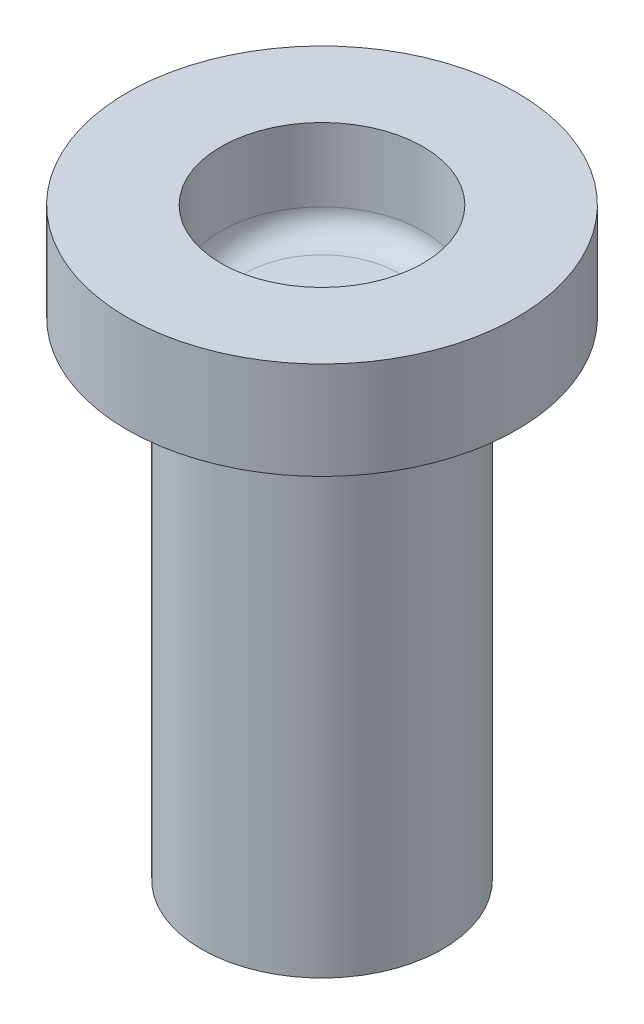
ISO-10303-21;
HEADER;
FILE_DESCRIPTION(('STEP AP214'),'2;1');
FILE_NAME('part.step','',(''),(''),'','','');
FILE_SCHEMA(('AUTOMOTIVE_DESIGN { 1 0 10303 214 1 1 1 1 }'));
ENDSEC;
DATA;
#1=APPLICATION_CONTEXT('core data for automotive mechanical design processes');
#2=APPLICATION_PROTOCOL_DEFINITION('international standard','automotive_design',2000,#1);
#3=PRODUCT_CONTEXT('',#1,'mechanical');
#4=PRODUCT('Part','Part','',(#3));
#5=PRODUCT_RELATED_PRODUCT_CATEGORY('part','',(#4));
#6=PRODUCT_DEFINITION_FORMATION('','',#4);
#7=PRODUCT_DEFINITION_CONTEXT('part definition',#1,'design');
#8=PRODUCT_DEFINITION('design','',#6,#7);
#9=PRODUCT_DEFINITION_SHAPE('','',#8);
#10=(LENGTH_UNIT() NAMED_UNIT(*) SI_UNIT(.MILLI.,.METRE.));
#11=(NAMED_UNIT(*) PLANE_ANGLE_UNIT() SI_UNIT($,.RADIAN.));
#12=(NAMED_UNIT(*) SI_UNIT($,.STERADIAN.) SOLID_ANGLE_UNIT());
#13=UNCERTAINTY_MEASURE_WITH_UNIT(LENGTH_MEASURE(1.E-05),#10,'distance_accuracy_value','');
#14=(GEOMETRIC_REPRESENTATION_CONTEXT(3) GLOBAL_UNCERTAINTY_ASSIGNED_CONTEXT((#13)) GLOBAL_UNIT_ASSIGNED_CONTEXT((#10,
#11,#12)) REPRESENTATION_CONTEXT('',''));
#15=CARTESIAN_POINT('',(0.,0.,0.));
#16=DIRECTION('',(0.,0.,1.));
#17=DIRECTION('',(1.,0.,0.));
#18=AXIS2_PLACEMENT_3D('',#15,#16,#17);
#19=CARTESIAN_POINT('',(0.,0.,0.));
#20=DIRECTION('',(0.,1.,0.));
#21=DIRECTION('',(0.,0.,1.));
#22=AXIS2_PLACEMENT_3D('',#19,#20,#21);
#23=PLANE('',#22);
#24=CARTESIAN_POINT('',(0.,0.,0.));
#25=DIRECTION('',(0.,1.,0.));
#26=DIRECTION('',(0.,0.,1.));
#27=AXIS2_PLACEMENT_3D('',#24,#25,#26);
#28=CIRCLE('',#27,2.475);
#29=CARTESIAN_POINT('',(0.,0.,2.475));
#30=VERTEX_POINT('',#29);
#31=EDGE_CURVE('E67',#30,#30,#28,.T.);
#32=ORIENTED_EDGE('',*,*,#31,.F.);
#33=EDGE_LOOP('',(#32));
#34=FACE_BOUND('',#33,.T.);
#35=CARTESIAN_POINT('',(0.,0.,0.));
#36=DIRECTION('',(0.,1.,0.));
#37=DIRECTION('',(0.,0.,1.));
#38=AXIS2_PLACEMENT_3D('',#35,#36,#37);
#39=CIRCLE('',#38,1.5);
#40=CARTESIAN_POINT('',(0.,0.,1.5));
#41=VERTEX_POINT('',#40);
#42=EDGE_CURVE('E71',#41,#41,#39,.T.);
#43=ORIENTED_EDGE('',*,*,#42,.T.);
#44=EDGE_LOOP('',(#43));
#45=FACE_BOUND('',#44,.T.);
#46=ADVANCED_FACE('F43',(#34,#45),#23,.F.);
#47=CARTESIAN_POINT('',(0.,5.,0.));
#48=DIRECTION('',(0.,-1.,0.));
#49=DIRECTION('',(0.,0.,-1.));
#50=AXIS2_PLACEMENT_3D('',#47,#48,#49);
#51=CYLINDRICAL_SURFACE('',#50,2.475);
#52=CARTESIAN_POINT('',(0.,9.5,0.));
#53=DIRECTION('',(0.,1.,0.));
#54=DIRECTION('',(0.,0.,1.));
#55=AXIS2_PLACEMENT_3D('',#52,#53,#54);
#56=CIRCLE('',#55,2.475);
#57=CARTESIAN_POINT('',(0.,9.5,2.475));
#58=VERTEX_POINT('',#57);
#59=EDGE_CURVE('E10',#58,#58,#56,.F.);
#60=ORIENTED_EDGE('',*,*,#59,.T.);
#61=EDGE_LOOP('',(#60));
#62=FACE_BOUND('',#61,.T.);
#63=ORIENTED_EDGE('',*,*,#31,.T.);
#64=EDGE_LOOP('',(#63));
#65=FACE_BOUND('',#64,.T.);
#66=ADVANCED_FACE('F117',(#62,#65),#51,.T.);
#67=CARTESIAN_POINT('',(0.,5.,0.));
#68=DIRECTION('',(0.,-1.,0.));
#69=DIRECTION('',(0.,0.,-1.));
#70=AXIS2_PLACEMENT_3D('',#67,#68,#69);
#71=CYLINDRICAL_SURFACE('',#70,1.5);
#72=CARTESIAN_POINT('',(0.,5.,0.));
#73=DIRECTION('',(0.,1.,0.));
#74=DIRECTION('',(0.,0.,1.));
#75=AXIS2_PLACEMENT_3D('',#72,#73,#74);
#76=CIRCLE('',#75,1.5);
#77=CARTESIAN_POINT('',(0.,5.,1.5));
#78=VERTEX_POINT('',#77);
#79=EDGE_CURVE('E75',#78,#78,#76,.T.);
#80=ORIENTED_EDGE('',*,*,#79,.T.);
#81=EDGE_LOOP('',(#80));
#82=FACE_BOUND('',#81,.T.);
#83=ORIENTED_EDGE('',*,*,#42,.F.);
#84=EDGE_LOOP('',(#83));
#85=FACE_BOUND('',#84,.T.);
#86=ADVANCED_FACE('F123',(#82,#85),#71,.F.);
#87=CARTESIAN_POINT('',(0.,5.,0.));
#88=DIRECTION('',(0.,1.,0.));
#89=DIRECTION('',(0.,0.,1.));
#90=AXIS2_PLACEMENT_3D('',#87,#88,#89);
#91=PLANE('',#90);
#92=ORIENTED_EDGE('',*,*,#79,.F.);
#93=EDGE_LOOP('',(#92));
#94=FACE_BOUND('',#93,.T.);
#95=ADVANCED_FACE('F99',(#94),#91,.F.);
#96=CARTESIAN_POINT('',(0.,12.,0.));
#97=DIRECTION('',(0.,-1.,0.));
#98=DIRECTION('',(0.,0.,-1.));
#99=AXIS2_PLACEMENT_3D('',#96,#97,#98);
#100=CYLINDRICAL_SURFACE('',#99,4.);
#101=CARTESIAN_POINT('',(0.,12.,0.));
#102=DIRECTION('',(0.,1.,0.));
#103=DIRECTION('',(0.,0.,1.));
#104=AXIS2_PLACEMENT_3D('',#101,#102,#103);
#105=CIRCLE('',#104,4.);
#106=CARTESIAN_POINT('',(0.,12.,4.));
#107=VERTEX_POINT('',#106);
#108=EDGE_CURVE('E84',#107,#107,#105,.T.);
#109=ORIENTED_EDGE('',*,*,#108,.F.);
#110=EDGE_LOOP('',(#109));
#111=FACE_BOUND('',#110,.T.);
#112=CARTESIAN_POINT('',(0.,10.,0.));
#113=DIRECTION('',(0.,1.,0.));
#114=DIRECTION('',(0.,0.,1.));
#115=AXIS2_PLACEMENT_3D('',#112,#113,#114);
#116=CIRCLE('',#115,4.);
#117=CARTESIAN_POINT('',(0.,10.,4.));
#118=VERTEX_POINT('',#117);
#119=EDGE_CURVE('E80',#118,#118,#116,.T.);
#120=ORIENTED_EDGE('',*,*,#119,.T.);
#121=EDGE_LOOP('',(#120));
#122=FACE_BOUND('',#121,.T.);
#123=ADVANCED_FACE('F95',(#111,#122),#100,.T.);
#124=CARTESIAN_POINT('',(0.,12.,0.));
#125=DIRECTION('',(0.,-1.,0.));
#126=DIRECTION('',(0.,0.,-1.));
#127=AXIS2_PLACEMENT_3D('',#124,#125,#126);
#128=CYLINDRICAL_SURFACE('',#127,2.075);
#129=CARTESIAN_POINT('',(0.,10.5,0.));
#130=DIRECTION('',(0.,1.,0.));
#131=DIRECTION('',(0.,0.,1.));
#132=AXIS2_PLACEMENT_3D('',#129,#130,#131);
#133=CIRCLE('',#132,2.075);
#134=CARTESIAN_POINT('',(0.,10.5,2.075));
#135=VERTEX_POINT('',#134);
#136=EDGE_CURVE('E61',#135,#135,#133,.F.);
#137=ORIENTED_EDGE('',*,*,#136,.T.);
#138=EDGE_LOOP('',(#137));
#139=FACE_BOUND('',#138,.T.);
#140=CARTESIAN_POINT('',(0.,12.,0.));
#141=DIRECTION('',(0.,1.,0.));
#142=DIRECTION('',(0.,0.,1.));
#143=AXIS2_PLACEMENT_3D('',#140,#141,#142);
#144=CIRCLE('',#143,2.075);
#145=CARTESIAN_POINT('',(0.,12.,2.075));
#146=VERTEX_POINT('',#145);
#147=EDGE_CURVE('E79',#146,#146,#144,.T.);
#148=ORIENTED_EDGE('',*,*,#147,.T.);
#149=EDGE_LOOP('',(#148));
#150=FACE_BOUND('',#149,.T.);
#151=ADVANCED_FACE('F98',(#139,#150),#128,.F.);
#152=CARTESIAN_POINT('',(0.,12.,0.));
#153=DIRECTION('',(0.,1.,0.));
#154=DIRECTION('',(0.,0.,1.));
#155=AXIS2_PLACEMENT_3D('',#152,#153,#154);
#156=PLANE('',#155);
#157=ORIENTED_EDGE('',*,*,#108,.T.);
#158=EDGE_LOOP('',(#157));
#159=FACE_BOUND('',#158,.T.);
#160=ORIENTED_EDGE('',*,*,#147,.F.);
#161=EDGE_LOOP('',(#160));
#162=FACE_BOUND('',#161,.T.);
#163=ADVANCED_FACE('F92',(#159,#162),#156,.T.);
#164=CARTESIAN_POINT('',(0.,10.,0.));
#165=DIRECTION('',(0.,1.,0.));
#166=DIRECTION('',(0.,0.,1.));
#167=AXIS2_PLACEMENT_3D('',#164,#165,#166);
#168=PLANE('',#167);
#169=CARTESIAN_POINT('',(0.,10.,0.));
#170=DIRECTION('',(0.,1.,0.));
#171=DIRECTION('',(0.,0.,1.));
#172=AXIS2_PLACEMENT_3D('',#169,#170,#171);
#173=CIRCLE('',#172,2.975);
#174=CARTESIAN_POINT('',(0.,10.,2.975));
#175=VERTEX_POINT('',#174);
#176=EDGE_CURVE('E51',#175,#175,#173,.T.);
#177=ORIENTED_EDGE('',*,*,#176,.T.);
#178=EDGE_LOOP('',(#177));
#179=FACE_BOUND('',#178,.T.);
#180=ORIENTED_EDGE('',*,*,#119,.F.);
#181=EDGE_LOOP('',(#180));
#182=FACE_BOUND('',#181,.T.);
#183=ADVANCED_FACE('F103',(#179,#182),#168,.F.);
#184=CARTESIAN_POINT('',(0.,10.,0.));
#185=DIRECTION('',(0.,1.,0.));
#186=DIRECTION('',(0.,0.,1.));
#187=AXIS2_PLACEMENT_3D('',#184,#185,#186);
#188=PLANE('',#187);
#189=CARTESIAN_POINT('',(0.,10.,0.));
#190=DIRECTION('',(0.,1.,0.));
#191=DIRECTION('',(0.,0.,1.));
#192=AXIS2_PLACEMENT_3D('',#189,#190,#191);
#193=CIRCLE('',#192,1.575);
#194=CARTESIAN_POINT('',(0.,10.,1.575));
#195=VERTEX_POINT('',#194);
#196=EDGE_CURVE('E56',#195,#195,#193,.T.);
#197=ORIENTED_EDGE('',*,*,#196,.T.);
#198=EDGE_LOOP('',(#197));
#199=FACE_BOUND('',#198,.T.);
#200=ADVANCED_FACE('F105',(#199),#188,.T.);
#201=CARTESIAN_POINT('',(0.,10.5,0.));
#202=DIRECTION('',(0.,1.,0.));
#203=DIRECTION('',(0.,0.,1.));
#204=AXIS2_PLACEMENT_3D('',#201,#202,#203);
#205=TOROIDAL_SURFACE('',#204,1.575,0.5);
#206=ORIENTED_EDGE('',*,*,#196,.F.);
#207=EDGE_LOOP('',(#206));
#208=FACE_BOUND('',#207,.T.);
#209=ORIENTED_EDGE('',*,*,#136,.F.);
#210=EDGE_LOOP('',(#209));
#211=FACE_BOUND('',#210,.T.);
#212=ADVANCED_FACE('F111',(#208,#211),#205,.F.);
#213=CARTESIAN_POINT('',(0.,9.5,0.));
#214=DIRECTION('',(0.,1.,0.));
#215=DIRECTION('',(0.,0.,1.));
#216=AXIS2_PLACEMENT_3D('',#213,#214,#215);
#217=TOROIDAL_SURFACE('',#216,2.975,0.5);
#218=ORIENTED_EDGE('',*,*,#59,.F.);
#219=EDGE_LOOP('',(#218));
#220=FACE_BOUND('',#219,.T.);
#221=ORIENTED_EDGE('',*,*,#176,.F.);
#222=EDGE_LOOP('',(#221));
#223=FACE_BOUND('',#222,.T.);
#224=ADVANCED_FACE('F45',(#220,#223),#217,.F.);
#225=CLOSED_SHELL('',(#46,#66,#86,#95,#123,#151,#163,#183,#200,#212,#224));
#226=MANIFOLD_SOLID_BREP('B2',#225);
#227=ADVANCED_BREP_SHAPE_REPRESENTATION('',(#18,#226),#14);
#228=SHAPE_DEFINITION_REPRESENTATION(#9,#227);
ENDSEC;
END-ISO-10303-21;
